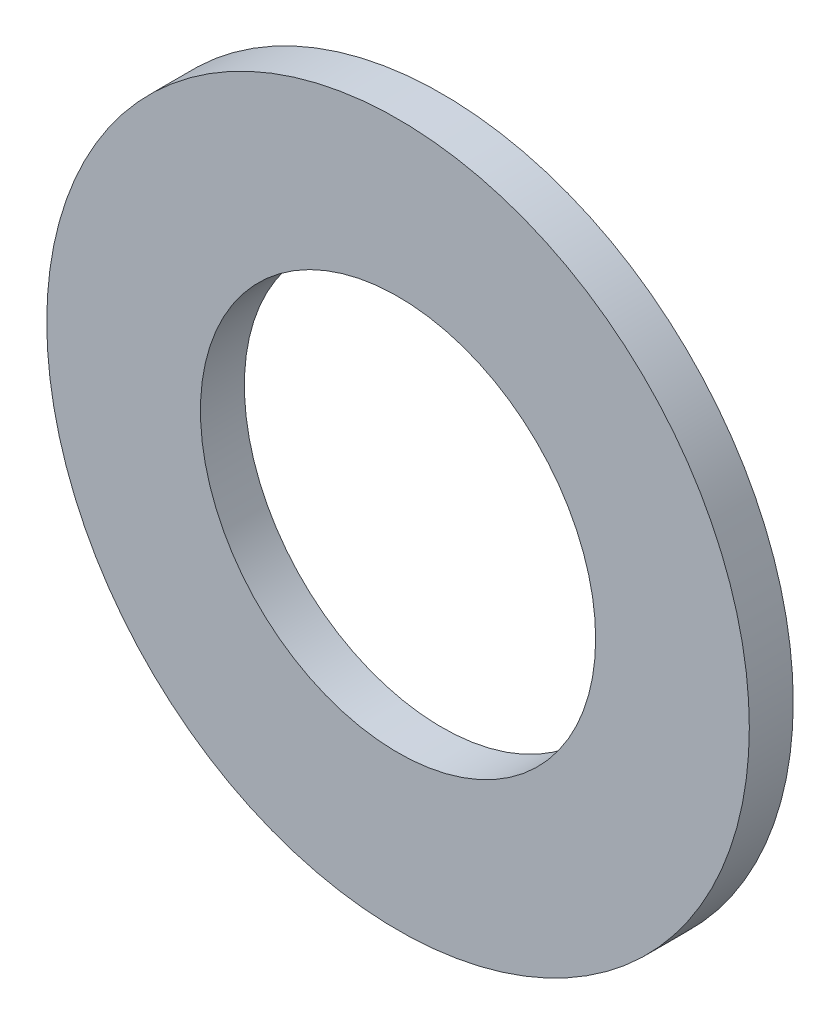
ISO-10303-21;
HEADER;
FILE_DESCRIPTION(('STEP AP214'),'2;1');
FILE_NAME('part.step','',(''),(''),'','','');
FILE_SCHEMA(('AUTOMOTIVE_DESIGN { 1 0 10303 214 1 1 1 1 }'));
ENDSEC;
DATA;
#1=APPLICATION_CONTEXT('core data for automotive mechanical design processes');
#2=APPLICATION_PROTOCOL_DEFINITION('international standard','automotive_design',2000,#1);
#3=PRODUCT_CONTEXT('',#1,'mechanical');
#4=PRODUCT('Part','Part','',(#3));
#5=PRODUCT_RELATED_PRODUCT_CATEGORY('part','',(#4));
#6=PRODUCT_DEFINITION_FORMATION('','',#4);
#7=PRODUCT_DEFINITION_CONTEXT('part definition',#1,'design');
#8=PRODUCT_DEFINITION('design','',#6,#7);
#9=PRODUCT_DEFINITION_SHAPE('','',#8);
#10=(LENGTH_UNIT() NAMED_UNIT(*) SI_UNIT(.MILLI.,.METRE.));
#11=(NAMED_UNIT(*) PLANE_ANGLE_UNIT() SI_UNIT($,.RADIAN.));
#12=(NAMED_UNIT(*) SI_UNIT($,.STERADIAN.) SOLID_ANGLE_UNIT());
#13=UNCERTAINTY_MEASURE_WITH_UNIT(LENGTH_MEASURE(1.E-05),#10,'distance_accuracy_value','');
#14=(GEOMETRIC_REPRESENTATION_CONTEXT(3) GLOBAL_UNCERTAINTY_ASSIGNED_CONTEXT((#13)) GLOBAL_UNIT_ASSIGNED_CONTEXT((#10,
#11,#12)) REPRESENTATION_CONTEXT('',''));
#15=CARTESIAN_POINT('',(0.,0.,0.));
#16=DIRECTION('',(0.,0.,1.));
#17=DIRECTION('',(1.,0.,0.));
#18=AXIS2_PLACEMENT_3D('',#15,#16,#17);
#19=CARTESIAN_POINT('',(-31.1719128120558,18.6720519363917,1.));
#20=DIRECTION('',(0.,0.,-1.));
#21=DIRECTION('',(-1.,0.,0.));
#22=AXIS2_PLACEMENT_3D('',#19,#20,#21);
#23=CYLINDRICAL_SURFACE('',#22,8.);
#24=CARTESIAN_POINT('',(-31.1719128120558,18.6720519363917,1.));
#25=DIRECTION('',(0.,0.,1.));
#26=DIRECTION('',(1.,0.,0.));
#27=AXIS2_PLACEMENT_3D('',#24,#25,#26);
#28=CIRCLE('',#27,8.);
#29=CARTESIAN_POINT('',(-23.1719128120558,18.6720519363917,1.));
#30=VERTEX_POINT('',#29);
#31=EDGE_CURVE('E10',#30,#30,#28,.T.);
#32=ORIENTED_EDGE('',*,*,#31,.F.);
#33=EDGE_LOOP('',(#32));
#34=FACE_BOUND('',#33,.T.);
#35=CARTESIAN_POINT('',(-31.1719128120558,18.6720519363917,0.));
#36=DIRECTION('',(0.,0.,1.));
#37=DIRECTION('',(1.,0.,0.));
#38=AXIS2_PLACEMENT_3D('',#35,#36,#37);
#39=CIRCLE('',#38,8.);
#40=CARTESIAN_POINT('',(-23.1719128120558,18.6720519363917,0.));
#41=VERTEX_POINT('',#40);
#42=EDGE_CURVE('E34',#41,#41,#39,.T.);
#43=ORIENTED_EDGE('',*,*,#42,.T.);
#44=EDGE_LOOP('',(#43));
#45=FACE_BOUND('',#44,.T.);
#46=ADVANCED_FACE('F31',(#34,#45),#23,.T.);
#47=CARTESIAN_POINT('',(-31.1719128120558,18.6720519363917,1.));
#48=DIRECTION('',(0.,0.,1.));
#49=DIRECTION('',(1.,0.,0.));
#50=AXIS2_PLACEMENT_3D('',#47,#48,#49);
#51=PLANE('',#50);
#52=CARTESIAN_POINT('',(-31.1719128120558,18.6720519363917,1.));
#53=DIRECTION('',(0.,0.,1.));
#54=DIRECTION('',(1.,0.,0.));
#55=AXIS2_PLACEMENT_3D('',#52,#53,#54);
#56=CIRCLE('',#55,4.5);
#57=CARTESIAN_POINT('',(-26.6719128120558,18.6720519363917,1.));
#58=VERTEX_POINT('',#57);
#59=EDGE_CURVE('E43',#58,#58,#56,.T.);
#60=ORIENTED_EDGE('',*,*,#59,.F.);
#61=EDGE_LOOP('',(#60));
#62=FACE_BOUND('',#61,.T.);
#63=ORIENTED_EDGE('',*,*,#31,.T.);
#64=EDGE_LOOP('',(#63));
#65=FACE_BOUND('',#64,.T.);
#66=ADVANCED_FACE('F58',(#62,#65),#51,.T.);
#67=CARTESIAN_POINT('',(-31.1719128120558,18.6720519363917,0.));
#68=DIRECTION('',(0.,0.,1.));
#69=DIRECTION('',(1.,0.,0.));
#70=AXIS2_PLACEMENT_3D('',#67,#68,#69);
#71=PLANE('',#70);
#72=CARTESIAN_POINT('',(-31.1719128120558,18.6720519363917,0.));
#73=DIRECTION('',(0.,0.,1.));
#74=DIRECTION('',(1.,0.,0.));
#75=AXIS2_PLACEMENT_3D('',#72,#73,#74);
#76=CIRCLE('',#75,4.5);
#77=CARTESIAN_POINT('',(-26.6719128120558,18.6720519363917,0.));
#78=VERTEX_POINT('',#77);
#79=EDGE_CURVE('E41',#78,#78,#76,.T.);
#80=ORIENTED_EDGE('',*,*,#79,.T.);
#81=EDGE_LOOP('',(#80));
#82=FACE_BOUND('',#81,.T.);
#83=ORIENTED_EDGE('',*,*,#42,.F.);
#84=EDGE_LOOP('',(#83));
#85=FACE_BOUND('',#84,.T.);
#86=ADVANCED_FACE('F49',(#82,#85),#71,.F.);
#87=CARTESIAN_POINT('',(-31.1719128120558,18.6720519363917,0.));
#88=DIRECTION('',(0.,0.,1.));
#89=DIRECTION('',(1.,0.,0.));
#90=AXIS2_PLACEMENT_3D('',#87,#88,#89);
#91=CYLINDRICAL_SURFACE('',#90,4.5);
#92=ORIENTED_EDGE('',*,*,#79,.F.);
#93=EDGE_LOOP('',(#92));
#94=FACE_BOUND('',#93,.T.);
#95=ORIENTED_EDGE('',*,*,#59,.T.);
#96=EDGE_LOOP('',(#95));
#97=FACE_BOUND('',#96,.T.);
#98=ADVANCED_FACE('F52',(#94,#97),#91,.F.);
#99=CLOSED_SHELL('',(#46,#66,#86,#98));
#100=MANIFOLD_SOLID_BREP('B2',#99);
#101=ADVANCED_BREP_SHAPE_REPRESENTATION('',(#18,#100),#14);
#102=SHAPE_DEFINITION_REPRESENTATION(#9,#101);
ENDSEC;
END-ISO-10303-21;
